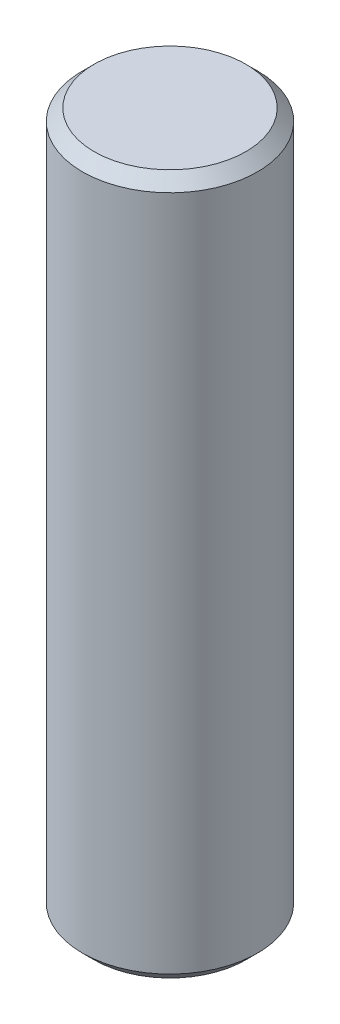
ISO-10303-21;
HEADER;
FILE_DESCRIPTION(('STEP AP214'),'2;1');
FILE_NAME('part.step','',(''),(''),'','','');
FILE_SCHEMA(('AUTOMOTIVE_DESIGN { 1 0 10303 214 1 1 1 1 }'));
ENDSEC;
DATA;
#1=APPLICATION_CONTEXT('core data for automotive mechanical design processes');
#2=APPLICATION_PROTOCOL_DEFINITION('international standard','automotive_design',2000,#1);
#3=PRODUCT_CONTEXT('',#1,'mechanical');
#4=PRODUCT('Part','Part','',(#3));
#5=PRODUCT_RELATED_PRODUCT_CATEGORY('part','',(#4));
#6=PRODUCT_DEFINITION_FORMATION('','',#4);
#7=PRODUCT_DEFINITION_CONTEXT('part definition',#1,'design');
#8=PRODUCT_DEFINITION('design','',#6,#7);
#9=PRODUCT_DEFINITION_SHAPE('','',#8);
#10=(LENGTH_UNIT() NAMED_UNIT(*) SI_UNIT(.MILLI.,.METRE.));
#11=(NAMED_UNIT(*) PLANE_ANGLE_UNIT() SI_UNIT($,.RADIAN.));
#12=(NAMED_UNIT(*) SI_UNIT($,.STERADIAN.) SOLID_ANGLE_UNIT());
#13=UNCERTAINTY_MEASURE_WITH_UNIT(LENGTH_MEASURE(1.E-05),#10,'distance_accuracy_value','');
#14=(GEOMETRIC_REPRESENTATION_CONTEXT(3) GLOBAL_UNCERTAINTY_ASSIGNED_CONTEXT((#13)) GLOBAL_UNIT_ASSIGNED_CONTEXT((#10,
#11,#12)) REPRESENTATION_CONTEXT('',''));
#15=CARTESIAN_POINT('',(0.,0.,0.));
#16=DIRECTION('',(0.,0.,1.));
#17=DIRECTION('',(1.,0.,0.));
#18=AXIS2_PLACEMENT_3D('',#15,#16,#17);
#19=CARTESIAN_POINT('',(0.,12.,0.));
#20=DIRECTION('',(0.,-1.,0.));
#21=DIRECTION('',(0.,0.,-1.));
#22=AXIS2_PLACEMENT_3D('',#19,#20,#21);
#23=CYLINDRICAL_SURFACE('',#22,1.5);
#24=CARTESIAN_POINT('',(0.,11.8,0.));
#25=DIRECTION('',(0.,1.,0.));
#26=DIRECTION('',(0.,0.,1.));
#27=AXIS2_PLACEMENT_3D('',#24,#25,#26);
#28=CIRCLE('',#27,1.5);
#29=CARTESIAN_POINT('',(0.,11.8,1.5));
#30=VERTEX_POINT('',#29);
#31=EDGE_CURVE('E50',#30,#30,#28,.F.);
#32=ORIENTED_EDGE('',*,*,#31,.T.);
#33=EDGE_LOOP('',(#32));
#34=FACE_BOUND('',#33,.T.);
#35=CARTESIAN_POINT('',(0.,0.199999999999997,0.));
#36=DIRECTION('',(0.,1.,0.));
#37=DIRECTION('',(0.,0.,1.));
#38=AXIS2_PLACEMENT_3D('',#35,#36,#37);
#39=CIRCLE('',#38,1.5);
#40=CARTESIAN_POINT('',(0.,0.199999999999997,1.5));
#41=VERTEX_POINT('',#40);
#42=EDGE_CURVE('E55',#41,#41,#39,.T.);
#43=ORIENTED_EDGE('',*,*,#42,.T.);
#44=EDGE_LOOP('',(#43));
#45=FACE_BOUND('',#44,.T.);
#46=ADVANCED_FACE('F41',(#34,#45),#23,.T.);
#47=CARTESIAN_POINT('',(0.,12.,0.));
#48=DIRECTION('',(0.,1.,0.));
#49=DIRECTION('',(0.,0.,1.));
#50=AXIS2_PLACEMENT_3D('',#47,#48,#49);
#51=PLANE('',#50);
#52=CARTESIAN_POINT('',(0.,12.,0.));
#53=DIRECTION('',(0.,1.,0.));
#54=DIRECTION('',(0.,0.,1.));
#55=AXIS2_PLACEMENT_3D('',#52,#53,#54);
#56=CIRCLE('',#55,1.3);
#57=CARTESIAN_POINT('',(0.,12.,1.3));
#58=VERTEX_POINT('',#57);
#59=EDGE_CURVE('E60',#58,#58,#56,.T.);
#60=ORIENTED_EDGE('',*,*,#59,.T.);
#61=EDGE_LOOP('',(#60));
#62=FACE_BOUND('',#61,.T.);
#63=ADVANCED_FACE('F67',(#62),#51,.T.);
#64=CARTESIAN_POINT('',(0.,0.,0.));
#65=DIRECTION('',(0.,1.,0.));
#66=DIRECTION('',(0.,0.,1.));
#67=AXIS2_PLACEMENT_3D('',#64,#65,#66);
#68=PLANE('',#67);
#69=CARTESIAN_POINT('',(0.,0.,0.));
#70=DIRECTION('',(0.,1.,0.));
#71=DIRECTION('',(0.,0.,1.));
#72=AXIS2_PLACEMENT_3D('',#69,#70,#71);
#73=CIRCLE('',#72,1.3);
#74=CARTESIAN_POINT('',(0.,0.,1.3));
#75=VERTEX_POINT('',#74);
#76=EDGE_CURVE('E10',#75,#75,#73,.F.);
#77=ORIENTED_EDGE('',*,*,#76,.T.);
#78=EDGE_LOOP('',(#77));
#79=FACE_BOUND('',#78,.T.);
#80=ADVANCED_FACE('F71',(#79),#68,.F.);
#81=CARTESIAN_POINT('',(0.,12.,0.));
#82=DIRECTION('',(0.,-1.,0.));
#83=DIRECTION('',(0.,0.,-1.));
#84=AXIS2_PLACEMENT_3D('',#81,#82,#83);
#85=CONICAL_SURFACE('',#84,1.3,0.785398163397446);
#86=ORIENTED_EDGE('',*,*,#31,.F.);
#87=EDGE_LOOP('',(#86));
#88=FACE_BOUND('',#87,.T.);
#89=ORIENTED_EDGE('',*,*,#59,.F.);
#90=EDGE_LOOP('',(#89));
#91=FACE_BOUND('',#90,.T.);
#92=ADVANCED_FACE('F69',(#88,#91),#85,.T.);
#93=CARTESIAN_POINT('',(0.,0.199999999999997,0.));
#94=DIRECTION('',(0.,1.,0.));
#95=DIRECTION('',(0.,0.,1.));
#96=AXIS2_PLACEMENT_3D('',#93,#94,#95);
#97=CONICAL_SURFACE('',#96,1.5,0.785398163397449);
#98=ORIENTED_EDGE('',*,*,#76,.F.);
#99=EDGE_LOOP('',(#98));
#100=FACE_BOUND('',#99,.T.);
#101=ORIENTED_EDGE('',*,*,#42,.F.);
#102=EDGE_LOOP('',(#101));
#103=FACE_BOUND('',#102,.T.);
#104=ADVANCED_FACE('F44',(#100,#103),#97,.T.);
#105=CLOSED_SHELL('',(#46,#63,#80,#92,#104));
#106=MANIFOLD_SOLID_BREP('B2',#105);
#107=ADVANCED_BREP_SHAPE_REPRESENTATION('',(#18,#106),#14);
#108=SHAPE_DEFINITION_REPRESENTATION(#9,#107);
ENDSEC;
END-ISO-10303-21;
